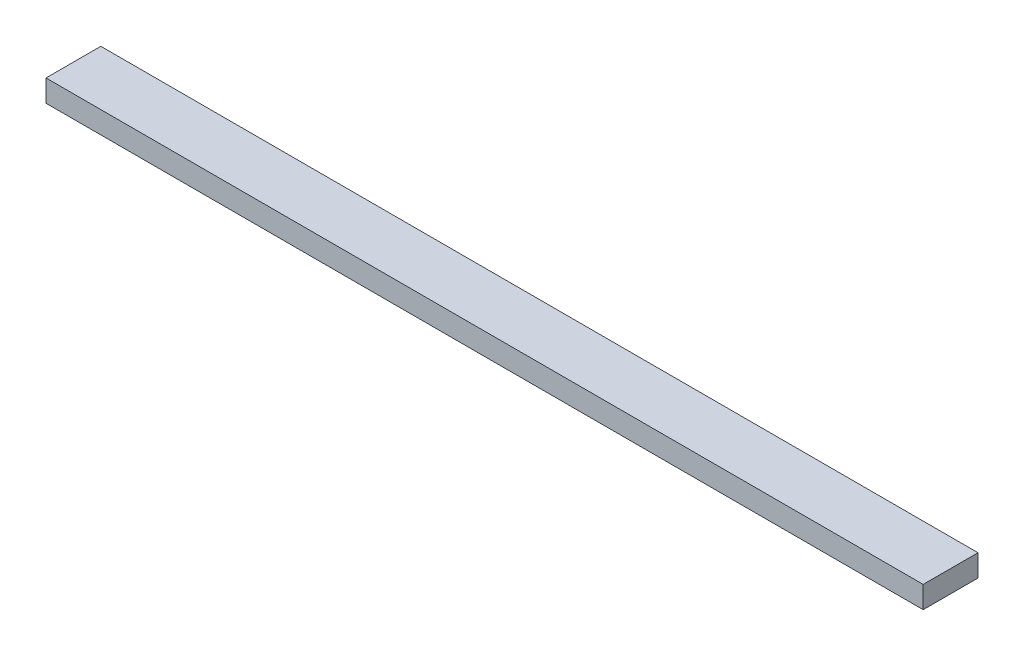
ISO-10303-21;
HEADER;
FILE_DESCRIPTION(('STEP AP214'),'2;1');
FILE_NAME('part.step','',(''),(''),'','','');
FILE_SCHEMA(('AUTOMOTIVE_DESIGN { 1 0 10303 214 1 1 1 1 }'));
ENDSEC;
DATA;
#1=APPLICATION_CONTEXT('core data for automotive mechanical design processes');
#2=APPLICATION_PROTOCOL_DEFINITION('international standard','automotive_design',2000,#1);
#3=PRODUCT_CONTEXT('',#1,'mechanical');
#4=PRODUCT('Part','Part','',(#3));
#5=PRODUCT_RELATED_PRODUCT_CATEGORY('part','',(#4));
#6=PRODUCT_DEFINITION_FORMATION('','',#4);
#7=PRODUCT_DEFINITION_CONTEXT('part definition',#1,'design');
#8=PRODUCT_DEFINITION('design','',#6,#7);
#9=PRODUCT_DEFINITION_SHAPE('','',#8);
#10=(LENGTH_UNIT() NAMED_UNIT(*) SI_UNIT(.MILLI.,.METRE.));
#11=(NAMED_UNIT(*) PLANE_ANGLE_UNIT() SI_UNIT($,.RADIAN.));
#12=(NAMED_UNIT(*) SI_UNIT($,.STERADIAN.) SOLID_ANGLE_UNIT());
#13=UNCERTAINTY_MEASURE_WITH_UNIT(LENGTH_MEASURE(1.E-05),#10,'distance_accuracy_value','');
#14=(GEOMETRIC_REPRESENTATION_CONTEXT(3) GLOBAL_UNCERTAINTY_ASSIGNED_CONTEXT((#13)) GLOBAL_UNIT_ASSIGNED_CONTEXT((#10,
#11,#12)) REPRESENTATION_CONTEXT('',''));
#15=CARTESIAN_POINT('',(0.,0.,0.));
#16=DIRECTION('',(0.,0.,1.));
#17=DIRECTION('',(1.,0.,0.));
#18=AXIS2_PLACEMENT_3D('',#15,#16,#17);
#19=CARTESIAN_POINT('',(400.,0.,0.));
#20=DIRECTION('',(0.,0.,-1.));
#21=DIRECTION('',(-1.,0.,0.));
#22=AXIS2_PLACEMENT_3D('',#19,#20,#21);
#23=PLANE('',#22);
#24=DIRECTION('',(0.,-1.,0.));
#25=VECTOR('',#24,1.);
#26=CARTESIAN_POINT('',(0.,0.,0.));
#27=LINE('',#26,#25);
#28=CARTESIAN_POINT('',(0.,10.,0.));
#29=VERTEX_POINT('',#28);
#30=CARTESIAN_POINT('',(0.,0.,0.));
#31=VERTEX_POINT('',#30);
#32=EDGE_CURVE('E107',#29,#31,#27,.T.);
#33=ORIENTED_EDGE('',*,*,#32,.T.);
#34=DIRECTION('',(-1.,0.,0.));
#35=VECTOR('',#34,1.);
#36=CARTESIAN_POINT('',(400.,0.,0.));
#37=LINE('',#36,#35);
#38=CARTESIAN_POINT('',(400.,0.,0.));
#39=VERTEX_POINT('',#38);
#40=EDGE_CURVE('E11',#39,#31,#37,.T.);
#41=ORIENTED_EDGE('',*,*,#40,.F.);
#42=DIRECTION('',(0.,-1.,0.));
#43=VECTOR('',#42,1.);
#44=CARTESIAN_POINT('',(400.,0.,0.));
#45=LINE('',#44,#43);
#46=CARTESIAN_POINT('',(400.,10.,0.));
#47=VERTEX_POINT('',#46);
#48=EDGE_CURVE('E91',#47,#39,#45,.T.);
#49=ORIENTED_EDGE('',*,*,#48,.F.);
#50=DIRECTION('',(-1.,0.,0.));
#51=VECTOR('',#50,1.);
#52=CARTESIAN_POINT('',(400.,10.,0.));
#53=LINE('',#52,#51);
#54=EDGE_CURVE('E103',#47,#29,#53,.T.);
#55=ORIENTED_EDGE('',*,*,#54,.T.);
#56=EDGE_LOOP('',(#33,#41,#49,#55));
#57=FACE_BOUND('',#56,.T.);
#58=ADVANCED_FACE('F39',(#57),#23,.F.);
#59=CARTESIAN_POINT('',(400.,0.,0.));
#60=DIRECTION('',(0.,1.,0.));
#61=DIRECTION('',(0.,0.,1.));
#62=AXIS2_PLACEMENT_3D('',#59,#60,#61);
#63=PLANE('',#62);
#64=DIRECTION('',(0.,0.,-1.));
#65=VECTOR('',#64,1.);
#66=CARTESIAN_POINT('',(0.,0.,0.));
#67=LINE('',#66,#65);
#68=CARTESIAN_POINT('',(0.,0.,-25.));
#69=VERTEX_POINT('',#68);
#70=EDGE_CURVE('E96',#31,#69,#67,.T.);
#71=ORIENTED_EDGE('',*,*,#70,.T.);
#72=DIRECTION('',(-1.,0.,0.));
#73=VECTOR('',#72,1.);
#74=CARTESIAN_POINT('',(400.,0.,-25.));
#75=LINE('',#74,#73);
#76=CARTESIAN_POINT('',(400.,0.,-25.));
#77=VERTEX_POINT('',#76);
#78=EDGE_CURVE('E48',#77,#69,#75,.T.);
#79=ORIENTED_EDGE('',*,*,#78,.F.);
#80=DIRECTION('',(0.,0.,-1.));
#81=VECTOR('',#80,1.);
#82=CARTESIAN_POINT('',(400.,0.,0.));
#83=LINE('',#82,#81);
#84=EDGE_CURVE('E86',#39,#77,#83,.T.);
#85=ORIENTED_EDGE('',*,*,#84,.F.);
#86=ORIENTED_EDGE('',*,*,#40,.T.);
#87=EDGE_LOOP('',(#71,#79,#85,#86));
#88=FACE_BOUND('',#87,.T.);
#89=ADVANCED_FACE('F95',(#88),#63,.F.);
#90=CARTESIAN_POINT('',(400.,0.,-25.));
#91=DIRECTION('',(0.,0.,1.));
#92=DIRECTION('',(1.,0.,0.));
#93=AXIS2_PLACEMENT_3D('',#90,#91,#92);
#94=PLANE('',#93);
#95=DIRECTION('',(0.,1.,0.));
#96=VECTOR('',#95,1.);
#97=CARTESIAN_POINT('',(0.,0.,-25.));
#98=LINE('',#97,#96);
#99=CARTESIAN_POINT('',(0.,10.,-25.));
#100=VERTEX_POINT('',#99);
#101=EDGE_CURVE('E73',#69,#100,#98,.T.);
#102=ORIENTED_EDGE('',*,*,#101,.T.);
#103=DIRECTION('',(-1.,0.,0.));
#104=VECTOR('',#103,1.);
#105=CARTESIAN_POINT('',(400.,10.,-25.));
#106=LINE('',#105,#104);
#107=CARTESIAN_POINT('',(400.,10.,-25.));
#108=VERTEX_POINT('',#107);
#109=EDGE_CURVE('E98',#108,#100,#106,.T.);
#110=ORIENTED_EDGE('',*,*,#109,.F.);
#111=DIRECTION('',(0.,1.,0.));
#112=VECTOR('',#111,1.);
#113=CARTESIAN_POINT('',(400.,0.,-25.));
#114=LINE('',#113,#112);
#115=EDGE_CURVE('E89',#77,#108,#114,.T.);
#116=ORIENTED_EDGE('',*,*,#115,.F.);
#117=ORIENTED_EDGE('',*,*,#78,.T.);
#118=EDGE_LOOP('',(#102,#110,#116,#117));
#119=FACE_BOUND('',#118,.T.);
#120=ADVANCED_FACE('F99',(#119),#94,.F.);
#121=CARTESIAN_POINT('',(400.,10.,0.));
#122=DIRECTION('',(0.,-1.,0.));
#123=DIRECTION('',(0.,0.,-1.));
#124=AXIS2_PLACEMENT_3D('',#121,#122,#123);
#125=PLANE('',#124);
#126=DIRECTION('',(0.,0.,1.));
#127=VECTOR('',#126,1.);
#128=CARTESIAN_POINT('',(0.,10.,0.));
#129=LINE('',#128,#127);
#130=EDGE_CURVE('E79',#100,#29,#129,.T.);
#131=ORIENTED_EDGE('',*,*,#130,.T.);
#132=ORIENTED_EDGE('',*,*,#54,.F.);
#133=DIRECTION('',(0.,0.,1.));
#134=VECTOR('',#133,1.);
#135=CARTESIAN_POINT('',(400.,10.,0.));
#136=LINE('',#135,#134);
#137=EDGE_CURVE('E56',#108,#47,#136,.T.);
#138=ORIENTED_EDGE('',*,*,#137,.F.);
#139=ORIENTED_EDGE('',*,*,#109,.T.);
#140=EDGE_LOOP('',(#131,#132,#138,#139));
#141=FACE_BOUND('',#140,.T.);
#142=ADVANCED_FACE('F120',(#141),#125,.F.);
#143=CARTESIAN_POINT('',(400.,0.,0.));
#144=DIRECTION('',(-1.,0.,0.));
#145=DIRECTION('',(0.,0.,1.));
#146=AXIS2_PLACEMENT_3D('',#143,#144,#145);
#147=PLANE('',#146);
#148=ORIENTED_EDGE('',*,*,#48,.T.);
#149=ORIENTED_EDGE('',*,*,#84,.T.);
#150=ORIENTED_EDGE('',*,*,#115,.T.);
#151=ORIENTED_EDGE('',*,*,#137,.T.);
#152=EDGE_LOOP('',(#148,#149,#150,#151));
#153=FACE_BOUND('',#152,.T.);
#154=ADVANCED_FACE('F87',(#153),#147,.F.);
#155=CARTESIAN_POINT('',(0.,0.,0.));
#156=DIRECTION('',(-1.,0.,0.));
#157=DIRECTION('',(0.,0.,1.));
#158=AXIS2_PLACEMENT_3D('',#155,#156,#157);
#159=PLANE('',#158);
#160=ORIENTED_EDGE('',*,*,#32,.F.);
#161=ORIENTED_EDGE('',*,*,#130,.F.);
#162=ORIENTED_EDGE('',*,*,#101,.F.);
#163=ORIENTED_EDGE('',*,*,#70,.F.);
#164=EDGE_LOOP('',(#160,#161,#162,#163));
#165=FACE_BOUND('',#164,.T.);
#166=ADVANCED_FACE('F123',(#165),#159,.T.);
#167=CLOSED_SHELL('',(#58,#89,#120,#142,#154,#166));
#168=MANIFOLD_SOLID_BREP('B2',#167);
#169=ADVANCED_BREP_SHAPE_REPRESENTATION('',(#18,#168),#14);
#170=SHAPE_DEFINITION_REPRESENTATION(#9,#169);
ENDSEC;
END-ISO-10303-21;
